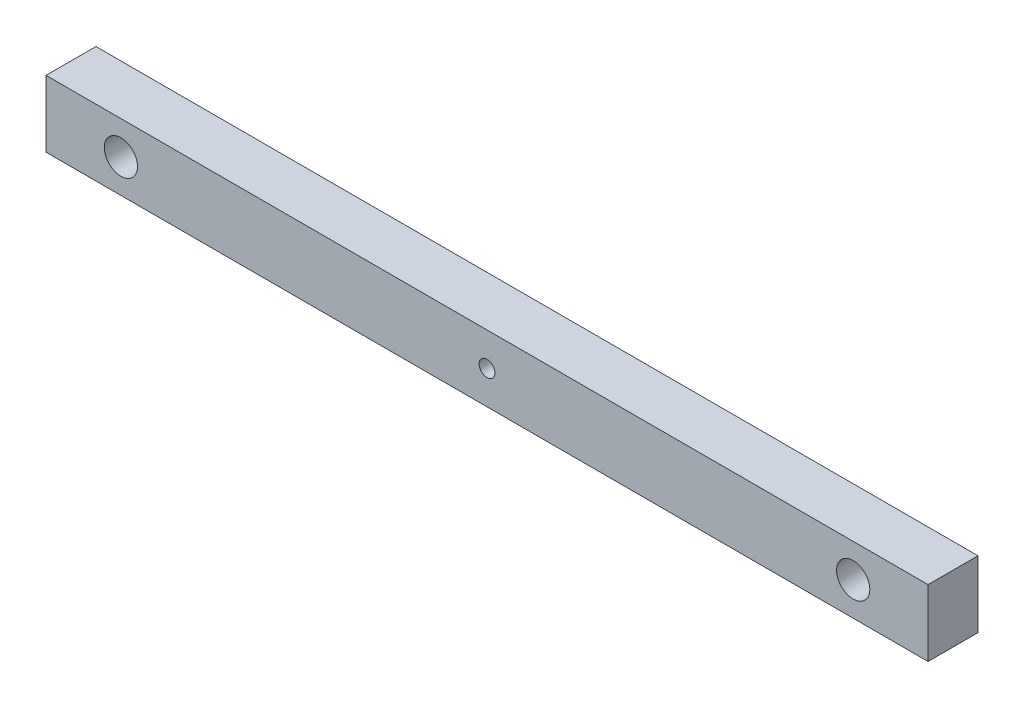
ISO-10303-21;
HEADER;
FILE_DESCRIPTION(('STEP AP214'),'2;1');
FILE_NAME('part.step','',(''),(''),'','','');
FILE_SCHEMA(('AUTOMOTIVE_DESIGN { 1 0 10303 214 1 1 1 1 }'));
ENDSEC;
DATA;
#1=APPLICATION_CONTEXT('core data for automotive mechanical design processes');
#2=APPLICATION_PROTOCOL_DEFINITION('international standard','automotive_design',2000,#1);
#3=PRODUCT_CONTEXT('',#1,'mechanical');
#4=PRODUCT('Part','Part','',(#3));
#5=PRODUCT_RELATED_PRODUCT_CATEGORY('part','',(#4));
#6=PRODUCT_DEFINITION_FORMATION('','',#4);
#7=PRODUCT_DEFINITION_CONTEXT('part definition',#1,'design');
#8=PRODUCT_DEFINITION('design','',#6,#7);
#9=PRODUCT_DEFINITION_SHAPE('','',#8);
#10=(LENGTH_UNIT() NAMED_UNIT(*) SI_UNIT(.MILLI.,.METRE.));
#11=(NAMED_UNIT(*) PLANE_ANGLE_UNIT() SI_UNIT($,.RADIAN.));
#12=(NAMED_UNIT(*) SI_UNIT($,.STERADIAN.) SOLID_ANGLE_UNIT());
#13=UNCERTAINTY_MEASURE_WITH_UNIT(LENGTH_MEASURE(1.E-05),#10,'distance_accuracy_value','');
#14=(GEOMETRIC_REPRESENTATION_CONTEXT(3) GLOBAL_UNCERTAINTY_ASSIGNED_CONTEXT((#13)) GLOBAL_UNIT_ASSIGNED_CONTEXT((#10,
#11,#12)) REPRESENTATION_CONTEXT('',''));
#15=CARTESIAN_POINT('',(0.,0.,0.));
#16=DIRECTION('',(0.,0.,1.));
#17=DIRECTION('',(1.,0.,0.));
#18=AXIS2_PLACEMENT_3D('',#15,#16,#17);
#19=CARTESIAN_POINT('',(-38.9122075776076,-2.,3.));
#20=DIRECTION('',(-1.,0.,0.));
#21=DIRECTION('',(0.,0.,1.));
#22=AXIS2_PLACEMENT_3D('',#19,#20,#21);
#23=PLANE('',#22);
#24=DIRECTION('',(0.,1.,0.));
#25=VECTOR('',#24,1.);
#26=CARTESIAN_POINT('',(-38.9122075776076,-2.,0.));
#27=LINE('',#26,#25);
#28=CARTESIAN_POINT('',(-38.9122075776076,-2.,0.));
#29=VERTEX_POINT('',#28);
#30=CARTESIAN_POINT('',(-38.9122075776076,2.,0.));
#31=VERTEX_POINT('',#30);
#32=EDGE_CURVE('E99',#29,#31,#27,.T.);
#33=ORIENTED_EDGE('',*,*,#32,.F.);
#34=DIRECTION('',(0.,0.,-1.));
#35=VECTOR('',#34,1.);
#36=CARTESIAN_POINT('',(-38.9122075776076,-2.,3.));
#37=LINE('',#36,#35);
#38=CARTESIAN_POINT('',(-38.9122075776076,-2.,3.));
#39=VERTEX_POINT('',#38);
#40=EDGE_CURVE('E11',#39,#29,#37,.T.);
#41=ORIENTED_EDGE('',*,*,#40,.F.);
#42=DIRECTION('',(0.,1.,0.));
#43=VECTOR('',#42,1.);
#44=CARTESIAN_POINT('',(-38.9122075776076,-2.,3.));
#45=LINE('',#44,#43);
#46=CARTESIAN_POINT('',(-38.9122075776076,2.,3.));
#47=VERTEX_POINT('',#46);
#48=EDGE_CURVE('E93',#39,#47,#45,.T.);
#49=ORIENTED_EDGE('',*,*,#48,.T.);
#50=DIRECTION('',(0.,0.,-1.));
#51=VECTOR('',#50,1.);
#52=CARTESIAN_POINT('',(-38.9122075776076,2.,3.));
#53=LINE('',#52,#51);
#54=EDGE_CURVE('E36',#47,#31,#53,.T.);
#55=ORIENTED_EDGE('',*,*,#54,.T.);
#56=EDGE_LOOP('',(#33,#41,#49,#55));
#57=FACE_BOUND('',#56,.T.);
#58=ADVANCED_FACE('F33',(#57),#23,.T.);
#59=CARTESIAN_POINT('',(-38.9122075776076,-2.,3.));
#60=DIRECTION('',(0.,1.,0.));
#61=DIRECTION('',(0.,0.,1.));
#62=AXIS2_PLACEMENT_3D('',#59,#60,#61);
#63=PLANE('',#62);
#64=DIRECTION('',(1.,0.,0.));
#65=VECTOR('',#64,1.);
#66=CARTESIAN_POINT('',(-38.9122075776076,-2.,0.));
#67=LINE('',#66,#65);
#68=CARTESIAN_POINT('',(14.0877924223924,-2.,0.));
#69=VERTEX_POINT('',#68);
#70=EDGE_CURVE('E66',#29,#69,#67,.T.);
#71=ORIENTED_EDGE('',*,*,#70,.T.);
#72=DIRECTION('',(0.,0.,-1.));
#73=VECTOR('',#72,1.);
#74=CARTESIAN_POINT('',(14.0877924223924,-2.,3.));
#75=LINE('',#74,#73);
#76=CARTESIAN_POINT('',(14.0877924223924,-2.,3.));
#77=VERTEX_POINT('',#76);
#78=EDGE_CURVE('E42',#77,#69,#75,.T.);
#79=ORIENTED_EDGE('',*,*,#78,.F.);
#80=DIRECTION('',(1.,0.,0.));
#81=VECTOR('',#80,1.);
#82=CARTESIAN_POINT('',(-38.9122075776076,-2.,3.));
#83=LINE('',#82,#81);
#84=EDGE_CURVE('E83',#39,#77,#83,.T.);
#85=ORIENTED_EDGE('',*,*,#84,.F.);
#86=ORIENTED_EDGE('',*,*,#40,.T.);
#87=EDGE_LOOP('',(#71,#79,#85,#86));
#88=FACE_BOUND('',#87,.T.);
#89=ADVANCED_FACE('F110',(#88),#63,.F.);
#90=CARTESIAN_POINT('',(14.0877924223924,-2.,3.));
#91=DIRECTION('',(-1.,0.,0.));
#92=DIRECTION('',(0.,0.,1.));
#93=AXIS2_PLACEMENT_3D('',#90,#91,#92);
#94=PLANE('',#93);
#95=DIRECTION('',(0.,1.,0.));
#96=VECTOR('',#95,1.);
#97=CARTESIAN_POINT('',(14.0877924223924,-2.,0.));
#98=LINE('',#97,#96);
#99=CARTESIAN_POINT('',(14.0877924223924,2.,0.));
#100=VERTEX_POINT('',#99);
#101=EDGE_CURVE('E90',#69,#100,#98,.T.);
#102=ORIENTED_EDGE('',*,*,#101,.T.);
#103=DIRECTION('',(0.,0.,-1.));
#104=VECTOR('',#103,1.);
#105=CARTESIAN_POINT('',(14.0877924223924,2.,3.));
#106=LINE('',#105,#104);
#107=CARTESIAN_POINT('',(14.0877924223924,2.,3.));
#108=VERTEX_POINT('',#107);
#109=EDGE_CURVE('E87',#108,#100,#106,.T.);
#110=ORIENTED_EDGE('',*,*,#109,.F.);
#111=DIRECTION('',(0.,1.,0.));
#112=VECTOR('',#111,1.);
#113=CARTESIAN_POINT('',(14.0877924223924,-2.,3.));
#114=LINE('',#113,#112);
#115=EDGE_CURVE('E78',#77,#108,#114,.T.);
#116=ORIENTED_EDGE('',*,*,#115,.F.);
#117=ORIENTED_EDGE('',*,*,#78,.T.);
#118=EDGE_LOOP('',(#102,#110,#116,#117));
#119=FACE_BOUND('',#118,.T.);
#120=ADVANCED_FACE('F88',(#119),#94,.F.);
#121=CARTESIAN_POINT('',(-38.9122075776076,2.,3.));
#122=DIRECTION('',(0.,1.,0.));
#123=DIRECTION('',(0.,0.,1.));
#124=AXIS2_PLACEMENT_3D('',#121,#122,#123);
#125=PLANE('',#124);
#126=DIRECTION('',(1.,0.,0.));
#127=VECTOR('',#126,1.);
#128=CARTESIAN_POINT('',(-38.9122075776076,2.,0.));
#129=LINE('',#128,#127);
#130=EDGE_CURVE('E102',#31,#100,#129,.T.);
#131=ORIENTED_EDGE('',*,*,#130,.F.);
#132=ORIENTED_EDGE('',*,*,#54,.F.);
#133=DIRECTION('',(1.,0.,0.));
#134=VECTOR('',#133,1.);
#135=CARTESIAN_POINT('',(-38.9122075776076,2.,3.));
#136=LINE('',#135,#134);
#137=EDGE_CURVE('E82',#47,#108,#136,.T.);
#138=ORIENTED_EDGE('',*,*,#137,.T.);
#139=ORIENTED_EDGE('',*,*,#109,.T.);
#140=EDGE_LOOP('',(#131,#132,#138,#139));
#141=FACE_BOUND('',#140,.T.);
#142=ADVANCED_FACE('F92',(#141),#125,.T.);
#143=CARTESIAN_POINT('',(0.,0.,3.));
#144=DIRECTION('',(0.,0.,-1.));
#145=DIRECTION('',(-1.,0.,0.));
#146=AXIS2_PLACEMENT_3D('',#143,#144,#145);
#147=PLANE('',#146);
#148=CARTESIAN_POINT('',(-12.4122075776076,0.,3.));
#149=DIRECTION('',(0.,0.,-1.));
#150=DIRECTION('',(-1.,0.,0.));
#151=AXIS2_PLACEMENT_3D('',#148,#149,#150);
#152=CIRCLE('',#151,0.475);
#153=CARTESIAN_POINT('',(-12.8872075776076,0.,3.));
#154=VERTEX_POINT('',#153);
#155=EDGE_CURVE('E148',#154,#154,#152,.T.);
#156=ORIENTED_EDGE('',*,*,#155,.T.);
#157=EDGE_LOOP('',(#156));
#158=FACE_BOUND('',#157,.T.);
#159=CARTESIAN_POINT('',(-34.4122075776076,0.,3.));
#160=DIRECTION('',(0.,0.,1.));
#161=DIRECTION('',(1.,0.,0.));
#162=AXIS2_PLACEMENT_3D('',#159,#160,#161);
#163=CIRCLE('',#162,0.999999999999998);
#164=CARTESIAN_POINT('',(-33.4122075776076,0.,3.));
#165=VERTEX_POINT('',#164);
#166=EDGE_CURVE('E158',#165,#165,#163,.T.);
#167=ORIENTED_EDGE('',*,*,#166,.F.);
#168=EDGE_LOOP('',(#167));
#169=FACE_BOUND('',#168,.T.);
#170=CARTESIAN_POINT('',(9.58779242239239,0.,3.));
#171=DIRECTION('',(0.,0.,1.));
#172=DIRECTION('',(1.,0.,0.));
#173=AXIS2_PLACEMENT_3D('',#170,#171,#172);
#174=CIRCLE('',#173,1.);
#175=CARTESIAN_POINT('',(10.5877924223924,0.,3.));
#176=VERTEX_POINT('',#175);
#177=EDGE_CURVE('E153',#176,#176,#174,.T.);
#178=ORIENTED_EDGE('',*,*,#177,.F.);
#179=EDGE_LOOP('',(#178));
#180=FACE_BOUND('',#179,.T.);
#181=ORIENTED_EDGE('',*,*,#48,.F.);
#182=ORIENTED_EDGE('',*,*,#84,.T.);
#183=ORIENTED_EDGE('',*,*,#115,.T.);
#184=ORIENTED_EDGE('',*,*,#137,.F.);
#185=EDGE_LOOP('',(#181,#182,#183,#184));
#186=FACE_BOUND('',#185,.T.);
#187=ADVANCED_FACE('F81',(#158,#169,#180,#186),#147,.F.);
#188=CARTESIAN_POINT('',(0.,0.,0.));
#189=DIRECTION('',(0.,0.,-1.));
#190=DIRECTION('',(-1.,0.,0.));
#191=AXIS2_PLACEMENT_3D('',#188,#189,#190);
#192=PLANE('',#191);
#193=CARTESIAN_POINT('',(-12.4122075776076,0.,0.));
#194=DIRECTION('',(0.,0.,-1.));
#195=DIRECTION('',(-1.,0.,0.));
#196=AXIS2_PLACEMENT_3D('',#193,#194,#195);
#197=CIRCLE('',#196,0.475);
#198=CARTESIAN_POINT('',(-12.8872075776076,0.,0.));
#199=VERTEX_POINT('',#198);
#200=EDGE_CURVE('E151',#199,#199,#197,.T.);
#201=ORIENTED_EDGE('',*,*,#200,.F.);
#202=EDGE_LOOP('',(#201));
#203=FACE_BOUND('',#202,.T.);
#204=CARTESIAN_POINT('',(-34.4122075776076,0.,0.));
#205=DIRECTION('',(0.,0.,1.));
#206=DIRECTION('',(1.,0.,0.));
#207=AXIS2_PLACEMENT_3D('',#204,#205,#206);
#208=CIRCLE('',#207,0.999999999999998);
#209=CARTESIAN_POINT('',(-33.4122075776076,0.,0.));
#210=VERTEX_POINT('',#209);
#211=EDGE_CURVE('E103',#210,#210,#208,.T.);
#212=ORIENTED_EDGE('',*,*,#211,.T.);
#213=EDGE_LOOP('',(#212));
#214=FACE_BOUND('',#213,.T.);
#215=CARTESIAN_POINT('',(9.58779242239239,0.,0.));
#216=DIRECTION('',(0.,0.,1.));
#217=DIRECTION('',(1.,0.,0.));
#218=AXIS2_PLACEMENT_3D('',#215,#216,#217);
#219=CIRCLE('',#218,1.);
#220=CARTESIAN_POINT('',(10.5877924223924,0.,0.));
#221=VERTEX_POINT('',#220);
#222=EDGE_CURVE('E161',#221,#221,#219,.T.);
#223=ORIENTED_EDGE('',*,*,#222,.T.);
#224=EDGE_LOOP('',(#223));
#225=FACE_BOUND('',#224,.T.);
#226=ORIENTED_EDGE('',*,*,#32,.T.);
#227=ORIENTED_EDGE('',*,*,#130,.T.);
#228=ORIENTED_EDGE('',*,*,#101,.F.);
#229=ORIENTED_EDGE('',*,*,#70,.F.);
#230=EDGE_LOOP('',(#226,#227,#228,#229));
#231=FACE_BOUND('',#230,.T.);
#232=ADVANCED_FACE('F108',(#203,#214,#225,#231),#192,.T.);
#233=CARTESIAN_POINT('',(9.58779242239239,0.,0.));
#234=DIRECTION('',(0.,0.,1.));
#235=DIRECTION('',(1.,0.,0.));
#236=AXIS2_PLACEMENT_3D('',#233,#234,#235);
#237=CYLINDRICAL_SURFACE('',#236,1.);
#238=ORIENTED_EDGE('',*,*,#222,.F.);
#239=EDGE_LOOP('',(#238));
#240=FACE_BOUND('',#239,.T.);
#241=ORIENTED_EDGE('',*,*,#177,.T.);
#242=EDGE_LOOP('',(#241));
#243=FACE_BOUND('',#242,.T.);
#244=ADVANCED_FACE('F129',(#240,#243),#237,.F.);
#245=CARTESIAN_POINT('',(-34.4122075776076,0.,0.));
#246=DIRECTION('',(0.,0.,1.));
#247=DIRECTION('',(1.,0.,0.));
#248=AXIS2_PLACEMENT_3D('',#245,#246,#247);
#249=CYLINDRICAL_SURFACE('',#248,0.999999999999998);
#250=ORIENTED_EDGE('',*,*,#211,.F.);
#251=EDGE_LOOP('',(#250));
#252=FACE_BOUND('',#251,.T.);
#253=ORIENTED_EDGE('',*,*,#166,.T.);
#254=EDGE_LOOP('',(#253));
#255=FACE_BOUND('',#254,.T.);
#256=ADVANCED_FACE('F136',(#252,#255),#249,.F.);
#257=CARTESIAN_POINT('',(-12.4122075776076,0.,3.));
#258=DIRECTION('',(0.,0.,-1.));
#259=DIRECTION('',(-1.,0.,0.));
#260=AXIS2_PLACEMENT_3D('',#257,#258,#259);
#261=CYLINDRICAL_SURFACE('',#260,0.475);
#262=ORIENTED_EDGE('',*,*,#155,.F.);
#263=EDGE_LOOP('',(#262));
#264=FACE_BOUND('',#263,.T.);
#265=ORIENTED_EDGE('',*,*,#200,.T.);
#266=EDGE_LOOP('',(#265));
#267=FACE_BOUND('',#266,.T.);
#268=ADVANCED_FACE('F140',(#264,#267),#261,.F.);
#269=CLOSED_SHELL('',(#58,#89,#120,#142,#187,#232,#244,#256,#268));
#270=MANIFOLD_SOLID_BREP('B2',#269);
#271=ADVANCED_BREP_SHAPE_REPRESENTATION('',(#18,#270),#14);
#272=SHAPE_DEFINITION_REPRESENTATION(#9,#271);
ENDSEC;
END-ISO-10303-21;
